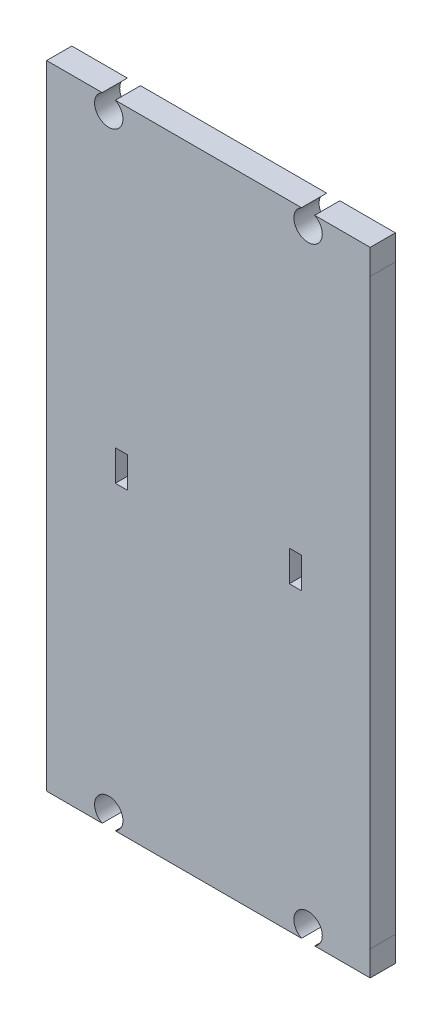
ISO-10303-21;
HEADER;
FILE_DESCRIPTION(('STEP AP214'),'2;1');
FILE_NAME('part.step','',(''),(''),'','','');
FILE_SCHEMA(('AUTOMOTIVE_DESIGN { 1 0 10303 214 1 1 1 1 }'));
ENDSEC;
DATA;
#1=APPLICATION_CONTEXT('core data for automotive mechanical design processes');
#2=APPLICATION_PROTOCOL_DEFINITION('international standard','automotive_design',2000,#1);
#3=PRODUCT_CONTEXT('',#1,'mechanical');
#4=PRODUCT('Part','Part','',(#3));
#5=PRODUCT_RELATED_PRODUCT_CATEGORY('part','',(#4));
#6=PRODUCT_DEFINITION_FORMATION('','',#4);
#7=PRODUCT_DEFINITION_CONTEXT('part definition',#1,'design');
#8=PRODUCT_DEFINITION('design','',#6,#7);
#9=PRODUCT_DEFINITION_SHAPE('','',#8);
#10=(LENGTH_UNIT() NAMED_UNIT(*) SI_UNIT(.MILLI.,.METRE.));
#11=(NAMED_UNIT(*) PLANE_ANGLE_UNIT() SI_UNIT($,.RADIAN.));
#12=(NAMED_UNIT(*) SI_UNIT($,.STERADIAN.) SOLID_ANGLE_UNIT());
#13=UNCERTAINTY_MEASURE_WITH_UNIT(LENGTH_MEASURE(1.E-05),#10,'distance_accuracy_value','');
#14=(GEOMETRIC_REPRESENTATION_CONTEXT(3) GLOBAL_UNCERTAINTY_ASSIGNED_CONTEXT((#13)) GLOBAL_UNIT_ASSIGNED_CONTEXT((#10,
#11,#12)) REPRESENTATION_CONTEXT('',''));
#15=CARTESIAN_POINT('',(0.,0.,0.));
#16=DIRECTION('',(0.,0.,1.));
#17=DIRECTION('',(1.,0.,0.));
#18=AXIS2_PLACEMENT_3D('',#15,#16,#17);
#19=CARTESIAN_POINT('',(12.4815956002516,-37.5639870162427,3.1115));
#20=DIRECTION('',(0.,0.,1.));
#21=DIRECTION('',(1.,0.,0.));
#22=AXIS2_PLACEMENT_3D('',#19,#20,#21);
#23=PLANE('',#22);
#24=DIRECTION('',(1.,0.,0.));
#25=VECTOR('',#24,1.);
#26=CARTESIAN_POINT('',(10.1620433458057,-1.9133805045045,3.1115));
#27=LINE('',#26,#25);
#28=CARTESIAN_POINT('',(10.1620433458057,-1.9133805045045,3.1115));
#29=VERTEX_POINT('',#28);
#30=CARTESIAN_POINT('',(11.6720433458056,-1.9133805045045,3.1115));
#31=VERTEX_POINT('',#30);
#32=EDGE_CURVE('E226',#29,#31,#27,.T.);
#33=ORIENTED_EDGE('',*,*,#32,.F.);
#34=DIRECTION('',(0.,-1.,0.));
#35=VECTOR('',#34,1.);
#36=CARTESIAN_POINT('',(10.1620433458057,1.89661949549551,3.1115));
#37=LINE('',#36,#35);
#38=CARTESIAN_POINT('',(10.1620433458057,1.89661949549551,3.1115));
#39=VERTEX_POINT('',#38);
#40=EDGE_CURVE('E224',#39,#29,#37,.T.);
#41=ORIENTED_EDGE('',*,*,#40,.F.);
#42=DIRECTION('',(-1.,0.,0.));
#43=VECTOR('',#42,1.);
#44=CARTESIAN_POINT('',(11.6720433458056,1.89661949549551,3.1115));
#45=LINE('',#44,#43);
#46=CARTESIAN_POINT('',(11.6720433458056,1.89661949549551,3.1115));
#47=VERTEX_POINT('',#46);
#48=EDGE_CURVE('E232',#47,#39,#45,.T.);
#49=ORIENTED_EDGE('',*,*,#48,.F.);
#50=DIRECTION('',(0.,1.,0.));
#51=VECTOR('',#50,1.);
#52=CARTESIAN_POINT('',(11.6720433458056,-1.9133805045045,3.1115));
#53=LINE('',#52,#51);
#54=EDGE_CURVE('E229',#31,#47,#53,.T.);
#55=ORIENTED_EDGE('',*,*,#54,.F.);
#56=EDGE_LOOP('',(#33,#41,#49,#55));
#57=FACE_BOUND('',#56,.T.);
#58=CARTESIAN_POINT('',(12.4815956002516,-37.5639870162427,3.1115));
#59=DIRECTION('',(0.,0.,-1.));
#60=DIRECTION('',(1.,0.,0.));
#61=AXIS2_PLACEMENT_3D('',#58,#59,#60);
#62=CIRCLE('',#61,1.75500000000009);
#63=CARTESIAN_POINT('',(11.6693674261273,-39.1197216957943,3.1115));
#64=VERTEX_POINT('',#63);
#65=CARTESIAN_POINT('',(13.2937654308429,-39.1197521547766,3.1115));
#66=VERTEX_POINT('',#65);
#67=EDGE_CURVE('E253',#64,#66,#62,.T.);
#68=ORIENTED_EDGE('',*,*,#67,.T.);
#69=DIRECTION('',(0.999999999824201,-1.87509355756312E-05,0.));
#70=VECTOR('',#69,1.);
#71=CARTESIAN_POINT('',(13.2937654308429,-39.1197521547766,3.1115));
#72=LINE('',#71,#70);
#73=CARTESIAN_POINT('',(20.161810992237,-39.1198809370565,3.1115));
#74=VERTEX_POINT('',#73);
#75=EDGE_CURVE('E256',#66,#74,#72,.T.);
#76=ORIENTED_EDGE('',*,*,#75,.T.);
#77=DIRECTION('',(1.87509355376572E-05,0.999999999824201,0.));
#78=VECTOR('',#77,1.);
#79=CARTESIAN_POINT('',(20.161810992237,-39.1198809370565,3.1115));
#80=LINE('',#79,#78);
#81=CARTESIAN_POINT('',(20.1618693076465,-36.0098809376032,3.1115));
#82=VERTEX_POINT('',#81);
#83=EDGE_CURVE('E259',#74,#82,#80,.T.);
#84=ORIENTED_EDGE('',*,*,#83,.T.);
#85=DIRECTION('',(4.78271407325755E-06,0.999999999988563,0.));
#86=VECTOR('',#85,1.);
#87=CARTESIAN_POINT('',(20.1622136630598,35.9901190615735,3.1115));
#88=LINE('',#87,#86);
#89=CARTESIAN_POINT('',(20.1622136630598,35.9901190615735,3.1115));
#90=VERTEX_POINT('',#89);
#91=EDGE_CURVE('E261',#82,#90,#88,.T.);
#92=ORIENTED_EDGE('',*,*,#91,.T.);
#93=DIRECTION('',(0.,1.,0.));
#94=VECTOR('',#93,1.);
#95=CARTESIAN_POINT('',(20.1622136630598,35.9901190615735,3.1115));
#96=LINE('',#95,#94);
#97=CARTESIAN_POINT('',(20.1622136630598,39.1001190584732,3.1115));
#98=VERTEX_POINT('',#97);
#99=EDGE_CURVE('E263',#90,#98,#96,.T.);
#100=ORIENTED_EDGE('',*,*,#99,.T.);
#101=DIRECTION('',(-1.,0.,0.));
#102=VECTOR('',#101,1.);
#103=CARTESIAN_POINT('',(20.1622136630598,39.1001190584732,3.1115));
#104=LINE('',#103,#102);
#105=CARTESIAN_POINT('',(13.2944987787251,39.1001190584732,3.1115));
#106=VERTEX_POINT('',#105);
#107=EDGE_CURVE('E265',#98,#106,#104,.T.);
#108=ORIENTED_EDGE('',*,*,#107,.T.);
#109=CARTESIAN_POINT('',(12.4822997762245,37.5443691491571,3.1115));
#110=DIRECTION('',(0.,0.,-1.));
#111=DIRECTION('',(-1.,0.,0.));
#112=AXIS2_PLACEMENT_3D('',#109,#110,#111);
#113=CIRCLE('',#112,1.75500000000001);
#114=CARTESIAN_POINT('',(11.6701007737239,39.1001190584732,3.1115));
#115=VERTEX_POINT('',#114);
#116=EDGE_CURVE('E267',#106,#115,#113,.T.);
#117=ORIENTED_EDGE('',*,*,#116,.T.);
#118=DIRECTION('',(-1.,0.,0.));
#119=VECTOR('',#118,1.);
#120=CARTESIAN_POINT('',(11.6701007737239,39.1001190584732,3.1115));
#121=LINE('',#120,#119);
#122=CARTESIAN_POINT('',(-11.3460140821123,39.1001190584732,3.1115));
#123=VERTEX_POINT('',#122);
#124=EDGE_CURVE('E269',#115,#123,#121,.T.);
#125=ORIENTED_EDGE('',*,*,#124,.T.);
#126=CARTESIAN_POINT('',(-12.1582130846129,37.5443691491571,3.1115));
#127=DIRECTION('',(0.,0.,-1.));
#128=DIRECTION('',(1.,0.,0.));
#129=AXIS2_PLACEMENT_3D('',#126,#127,#128);
#130=CIRCLE('',#129,1.75500000000001);
#131=CARTESIAN_POINT('',(-12.9704120871134,39.1001190584732,3.1115));
#132=VERTEX_POINT('',#131);
#133=EDGE_CURVE('E271',#123,#132,#130,.T.);
#134=ORIENTED_EDGE('',*,*,#133,.T.);
#135=DIRECTION('',(-1.,0.,0.));
#136=VECTOR('',#135,1.);
#137=CARTESIAN_POINT('',(-12.9704120871134,39.1001190584732,3.1115));
#138=LINE('',#137,#136);
#139=CARTESIAN_POINT('',(-19.8378399810143,39.1001190584732,3.1115));
#140=VERTEX_POINT('',#139);
#141=EDGE_CURVE('E273',#132,#140,#138,.T.);
#142=ORIENTED_EDGE('',*,*,#141,.T.);
#143=DIRECTION('',(-1.32158172241815E-06,-0.999999999999127,0.));
#144=VECTOR('',#143,1.);
#145=CARTESIAN_POINT('',(-19.8378399810143,39.1001190584732,3.1115));
#146=LINE('',#145,#144);
#147=CARTESIAN_POINT('',(-19.8379392440263,-36.0091309040397,3.1115));
#148=VERTEX_POINT('',#147);
#149=EDGE_CURVE('E275',#140,#148,#146,.T.);
#150=ORIENTED_EDGE('',*,*,#149,.T.);
#151=DIRECTION('',(-5.59642769559456E-06,-0.99999999998434,0.));
#152=VECTOR('',#151,1.);
#153=CARTESIAN_POINT('',(-19.8379392440263,-36.0091309040397,3.1115));
#154=LINE('',#153,#152);
#155=CARTESIAN_POINT('',(-19.8379566489164,-39.119130903991,3.1115));
#156=VERTEX_POINT('',#155);
#157=EDGE_CURVE('E277',#148,#156,#154,.T.);
#158=ORIENTED_EDGE('',*,*,#157,.T.);
#159=DIRECTION('',(0.999999999824201,-1.87509355584966E-05,0.));
#160=VECTOR('',#159,1.);
#161=CARTESIAN_POINT('',(-19.8379566489164,-39.119130903991,3.1115));
#162=LINE('',#161,#160);
#163=CARTESIAN_POINT('',(-12.9711454303783,-39.1192596631256,3.1115));
#164=VERTEX_POINT('',#163);
#165=EDGE_CURVE('E279',#156,#164,#162,.T.);
#166=ORIENTED_EDGE('',*,*,#165,.T.);
#167=CARTESIAN_POINT('',(-12.158917256254,-37.5635249835742,3.1115));
#168=DIRECTION('',(0.,0.,-1.));
#169=DIRECTION('',(-1.,0.,0.));
#170=AXIS2_PLACEMENT_3D('',#167,#168,#169);
#171=CIRCLE('',#170,1.75500000000001);
#172=CARTESIAN_POINT('',(-11.3467474256626,-39.119290122108,3.1115));
#173=VERTEX_POINT('',#172);
#174=EDGE_CURVE('E281',#164,#173,#171,.T.);
#175=ORIENTED_EDGE('',*,*,#174,.T.);
#176=DIRECTION('',(0.999999999824201,-1.87509355536629E-05,0.));
#177=VECTOR('',#176,1.);
#178=CARTESIAN_POINT('',(-11.3467474256627,-39.1192901221079,3.1115));
#179=LINE('',#178,#177);
#180=EDGE_CURVE('E283',#173,#64,#179,.T.);
#181=ORIENTED_EDGE('',*,*,#180,.T.);
#182=EDGE_LOOP('',(#68,#76,#84,#92,#100,#108,#117,#125,#134,#142,#150,#158,#166,#175,#181));
#183=FACE_BOUND('',#182,.T.);
#184=DIRECTION('',(0.,-1.,0.));
#185=VECTOR('',#184,1.);
#186=CARTESIAN_POINT('',(-11.3479566541943,-1.9133805045045,3.1115));
#187=LINE('',#186,#185);
#188=CARTESIAN_POINT('',(-11.3479566541943,1.89661949549551,3.1115));
#189=VERTEX_POINT('',#188);
#190=CARTESIAN_POINT('',(-11.3479566541943,-1.9133805045045,3.1115));
#191=VERTEX_POINT('',#190);
#192=EDGE_CURVE('E196',#189,#191,#187,.T.);
#193=ORIENTED_EDGE('',*,*,#192,.F.);
#194=DIRECTION('',(-1.,0.,0.));
#195=VECTOR('',#194,1.);
#196=CARTESIAN_POINT('',(-11.3479566541943,1.89661949549551,3.1115));
#197=LINE('',#196,#195);
#198=CARTESIAN_POINT('',(-9.83795665419433,1.89661949549551,3.1115));
#199=VERTEX_POINT('',#198);
#200=EDGE_CURVE('E188',#199,#189,#197,.T.);
#201=ORIENTED_EDGE('',*,*,#200,.F.);
#202=DIRECTION('',(0.,1.,0.));
#203=VECTOR('',#202,1.);
#204=CARTESIAN_POINT('',(-9.83795665419433,-0.00838050450450989,3.1115));
#205=LINE('',#204,#203);
#206=CARTESIAN_POINT('',(-9.83795665419433,-1.9133805045045,3.1115));
#207=VERTEX_POINT('',#206);
#208=EDGE_CURVE('E210',#207,#199,#205,.T.);
#209=ORIENTED_EDGE('',*,*,#208,.F.);
#210=DIRECTION('',(1.,0.,0.));
#211=VECTOR('',#210,1.);
#212=CARTESIAN_POINT('',(-9.83795665419433,-1.9133805045045,3.1115));
#213=LINE('',#212,#211);
#214=EDGE_CURVE('E208',#191,#207,#213,.T.);
#215=ORIENTED_EDGE('',*,*,#214,.F.);
#216=EDGE_LOOP('',(#193,#201,#209,#215));
#217=FACE_BOUND('',#216,.T.);
#218=ADVANCED_FACE('F33',(#57,#183,#217),#23,.T.);
#219=CARTESIAN_POINT('',(12.4815956002516,-37.5639870162427,0.));
#220=DIRECTION('',(0.,0.,1.));
#221=DIRECTION('',(1.,0.,0.));
#222=AXIS2_PLACEMENT_3D('',#219,#220,#221);
#223=PLANE('',#222);
#224=DIRECTION('',(0.,-1.,0.));
#225=VECTOR('',#224,1.);
#226=CARTESIAN_POINT('',(10.1620433458057,-0.00838050450450989,0.));
#227=LINE('',#226,#225);
#228=CARTESIAN_POINT('',(10.1620433458057,1.89661949549551,0.));
#229=VERTEX_POINT('',#228);
#230=CARTESIAN_POINT('',(10.1620433458057,-1.9133805045045,0.));
#231=VERTEX_POINT('',#230);
#232=EDGE_CURVE('E204',#229,#231,#227,.T.);
#233=ORIENTED_EDGE('',*,*,#232,.T.);
#234=DIRECTION('',(1.,0.,0.));
#235=VECTOR('',#234,1.);
#236=CARTESIAN_POINT('',(10.1620433458057,-1.9133805045045,0.));
#237=LINE('',#236,#235);
#238=CARTESIAN_POINT('',(11.6720433458056,-1.9133805045045,0.));
#239=VERTEX_POINT('',#238);
#240=EDGE_CURVE('E237',#231,#239,#237,.T.);
#241=ORIENTED_EDGE('',*,*,#240,.T.);
#242=DIRECTION('',(0.,1.,0.));
#243=VECTOR('',#242,1.);
#244=CARTESIAN_POINT('',(11.6720433458056,-1.9133805045045,0.));
#245=LINE('',#244,#243);
#246=CARTESIAN_POINT('',(11.6720433458056,1.89661949549551,0.));
#247=VERTEX_POINT('',#246);
#248=EDGE_CURVE('E240',#239,#247,#245,.T.);
#249=ORIENTED_EDGE('',*,*,#248,.T.);
#250=DIRECTION('',(-1.,0.,0.));
#251=VECTOR('',#250,1.);
#252=CARTESIAN_POINT('',(11.6720433458056,1.89661949549551,0.));
#253=LINE('',#252,#251);
#254=EDGE_CURVE('E227',#247,#229,#253,.T.);
#255=ORIENTED_EDGE('',*,*,#254,.T.);
#256=EDGE_LOOP('',(#233,#241,#249,#255));
#257=FACE_BOUND('',#256,.T.);
#258=CARTESIAN_POINT('',(12.4815956002516,-37.5639870162427,0.));
#259=DIRECTION('',(0.,0.,-1.));
#260=DIRECTION('',(1.,0.,0.));
#261=AXIS2_PLACEMENT_3D('',#258,#259,#260);
#262=CIRCLE('',#261,1.75500000000009);
#263=CARTESIAN_POINT('',(11.6693674261273,-39.1197216957943,0.));
#264=VERTEX_POINT('',#263);
#265=CARTESIAN_POINT('',(13.2937654308429,-39.1197521547766,0.));
#266=VERTEX_POINT('',#265);
#267=EDGE_CURVE('E252',#264,#266,#262,.T.);
#268=ORIENTED_EDGE('',*,*,#267,.F.);
#269=DIRECTION('',(0.999999999824201,-1.87509355536629E-05,0.));
#270=VECTOR('',#269,1.);
#271=CARTESIAN_POINT('',(-11.3467474256627,-39.1192901221079,0.));
#272=LINE('',#271,#270);
#273=CARTESIAN_POINT('',(-11.3467474256626,-39.119290122108,0.));
#274=VERTEX_POINT('',#273);
#275=EDGE_CURVE('E257',#274,#264,#272,.T.);
#276=ORIENTED_EDGE('',*,*,#275,.F.);
#277=CARTESIAN_POINT('',(-12.158917256254,-37.5635249835742,0.));
#278=DIRECTION('',(0.,0.,-1.));
#279=DIRECTION('',(-1.,0.,0.));
#280=AXIS2_PLACEMENT_3D('',#277,#278,#279);
#281=CIRCLE('',#280,1.75500000000001);
#282=CARTESIAN_POINT('',(-12.9711454303783,-39.1192596631256,0.));
#283=VERTEX_POINT('',#282);
#284=EDGE_CURVE('E313',#283,#274,#281,.T.);
#285=ORIENTED_EDGE('',*,*,#284,.F.);
#286=DIRECTION('',(0.999999999824201,-1.87509355584966E-05,0.));
#287=VECTOR('',#286,1.);
#288=CARTESIAN_POINT('',(-19.8379566489164,-39.119130903991,0.));
#289=LINE('',#288,#287);
#290=CARTESIAN_POINT('',(-19.8379566489164,-39.119130903991,0.));
#291=VERTEX_POINT('',#290);
#292=EDGE_CURVE('E311',#291,#283,#289,.T.);
#293=ORIENTED_EDGE('',*,*,#292,.F.);
#294=DIRECTION('',(-5.59642769559456E-06,-0.99999999998434,0.));
#295=VECTOR('',#294,1.);
#296=CARTESIAN_POINT('',(-19.8379392440263,-36.0091309040397,0.));
#297=LINE('',#296,#295);
#298=CARTESIAN_POINT('',(-19.8379392440263,-36.0091309040397,0.));
#299=VERTEX_POINT('',#298);
#300=EDGE_CURVE('E309',#299,#291,#297,.T.);
#301=ORIENTED_EDGE('',*,*,#300,.F.);
#302=DIRECTION('',(-1.32158172241815E-06,-0.999999999999127,0.));
#303=VECTOR('',#302,1.);
#304=CARTESIAN_POINT('',(-19.8378399810143,39.1001190584732,0.));
#305=LINE('',#304,#303);
#306=CARTESIAN_POINT('',(-19.8378399810143,39.1001190584732,0.));
#307=VERTEX_POINT('',#306);
#308=EDGE_CURVE('E307',#307,#299,#305,.T.);
#309=ORIENTED_EDGE('',*,*,#308,.F.);
#310=DIRECTION('',(-1.,0.,0.));
#311=VECTOR('',#310,1.);
#312=CARTESIAN_POINT('',(-12.9704120871134,39.1001190584732,0.));
#313=LINE('',#312,#311);
#314=CARTESIAN_POINT('',(-12.9704120871134,39.1001190584732,0.));
#315=VERTEX_POINT('',#314);
#316=EDGE_CURVE('E305',#315,#307,#313,.T.);
#317=ORIENTED_EDGE('',*,*,#316,.F.);
#318=CARTESIAN_POINT('',(-12.1582130846129,37.5443691491571,0.));
#319=DIRECTION('',(0.,0.,-1.));
#320=DIRECTION('',(1.,0.,0.));
#321=AXIS2_PLACEMENT_3D('',#318,#319,#320);
#322=CIRCLE('',#321,1.75500000000001);
#323=CARTESIAN_POINT('',(-11.3460140821123,39.1001190584732,0.));
#324=VERTEX_POINT('',#323);
#325=EDGE_CURVE('E303',#324,#315,#322,.T.);
#326=ORIENTED_EDGE('',*,*,#325,.F.);
#327=DIRECTION('',(-1.,0.,0.));
#328=VECTOR('',#327,1.);
#329=CARTESIAN_POINT('',(11.6701007737239,39.1001190584732,0.));
#330=LINE('',#329,#328);
#331=CARTESIAN_POINT('',(11.6701007737239,39.1001190584732,0.));
#332=VERTEX_POINT('',#331);
#333=EDGE_CURVE('E301',#332,#324,#330,.T.);
#334=ORIENTED_EDGE('',*,*,#333,.F.);
#335=CARTESIAN_POINT('',(12.4822997762245,37.5443691491571,0.));
#336=DIRECTION('',(0.,0.,-1.));
#337=DIRECTION('',(-1.,0.,0.));
#338=AXIS2_PLACEMENT_3D('',#335,#336,#337);
#339=CIRCLE('',#338,1.75500000000001);
#340=CARTESIAN_POINT('',(13.2944987787251,39.1001190584732,0.));
#341=VERTEX_POINT('',#340);
#342=EDGE_CURVE('E299',#341,#332,#339,.T.);
#343=ORIENTED_EDGE('',*,*,#342,.F.);
#344=DIRECTION('',(-1.,0.,0.));
#345=VECTOR('',#344,1.);
#346=CARTESIAN_POINT('',(13.3522375558519,39.1001190584732,0.));
#347=LINE('',#346,#345);
#348=CARTESIAN_POINT('',(20.1622136630598,39.1001190584732,0.));
#349=VERTEX_POINT('',#348);
#350=EDGE_CURVE('E297',#349,#341,#347,.T.);
#351=ORIENTED_EDGE('',*,*,#350,.F.);
#352=DIRECTION('',(0.,1.,0.));
#353=VECTOR('',#352,1.);
#354=CARTESIAN_POINT('',(20.1622136630598,35.9901190615735,0.));
#355=LINE('',#354,#353);
#356=CARTESIAN_POINT('',(20.1622136630598,35.9901190615735,0.));
#357=VERTEX_POINT('',#356);
#358=EDGE_CURVE('E294',#357,#349,#355,.T.);
#359=ORIENTED_EDGE('',*,*,#358,.F.);
#360=DIRECTION('',(4.78271407325755E-06,0.999999999988563,0.));
#361=VECTOR('',#360,1.);
#362=CARTESIAN_POINT('',(20.1622136630598,35.9901190615735,0.));
#363=LINE('',#362,#361);
#364=CARTESIAN_POINT('',(20.1618693076465,-36.0098809376032,0.));
#365=VERTEX_POINT('',#364);
#366=EDGE_CURVE('E292',#365,#357,#363,.T.);
#367=ORIENTED_EDGE('',*,*,#366,.F.);
#368=DIRECTION('',(1.87509355376572E-05,0.999999999824201,0.));
#369=VECTOR('',#368,1.);
#370=CARTESIAN_POINT('',(20.161810992237,-39.1198809370565,0.));
#371=LINE('',#370,#369);
#372=CARTESIAN_POINT('',(20.161810992237,-39.1198809370565,0.));
#373=VERTEX_POINT('',#372);
#374=EDGE_CURVE('E290',#373,#365,#371,.T.);
#375=ORIENTED_EDGE('',*,*,#374,.F.);
#376=DIRECTION('',(0.999999999824201,-1.87509355756312E-05,0.));
#377=VECTOR('',#376,1.);
#378=CARTESIAN_POINT('',(13.2937654308429,-39.1197521547766,0.));
#379=LINE('',#378,#377);
#380=EDGE_CURVE('E288',#266,#373,#379,.T.);
#381=ORIENTED_EDGE('',*,*,#380,.F.);
#382=EDGE_LOOP('',(#268,#276,#285,#293,#301,#309,#317,#326,#334,#343,#351,#359,#367,#375,#381));
#383=FACE_BOUND('',#382,.T.);
#384=DIRECTION('',(-1.,0.,0.));
#385=VECTOR('',#384,1.);
#386=CARTESIAN_POINT('',(-11.3479566541943,1.89661949549551,0.));
#387=LINE('',#386,#385);
#388=CARTESIAN_POINT('',(-9.83795665419433,1.89661949549551,0.));
#389=VERTEX_POINT('',#388);
#390=CARTESIAN_POINT('',(-11.3479566541943,1.89661949549551,0.));
#391=VERTEX_POINT('',#390);
#392=EDGE_CURVE('E56',#389,#391,#387,.T.);
#393=ORIENTED_EDGE('',*,*,#392,.T.);
#394=DIRECTION('',(0.,-1.,0.));
#395=VECTOR('',#394,1.);
#396=CARTESIAN_POINT('',(-11.3479566541943,-1.9133805045045,0.));
#397=LINE('',#396,#395);
#398=CARTESIAN_POINT('',(-11.3479566541943,-1.9133805045045,0.));
#399=VERTEX_POINT('',#398);
#400=EDGE_CURVE('E203',#391,#399,#397,.T.);
#401=ORIENTED_EDGE('',*,*,#400,.T.);
#402=DIRECTION('',(1.,0.,0.));
#403=VECTOR('',#402,1.);
#404=CARTESIAN_POINT('',(-9.83795665419433,-1.9133805045045,0.));
#405=LINE('',#404,#403);
#406=CARTESIAN_POINT('',(-9.83795665419433,-1.9133805045045,0.));
#407=VERTEX_POINT('',#406);
#408=EDGE_CURVE('E216',#399,#407,#405,.T.);
#409=ORIENTED_EDGE('',*,*,#408,.T.);
#410=DIRECTION('',(0.,1.,0.));
#411=VECTOR('',#410,1.);
#412=CARTESIAN_POINT('',(-9.83795665419433,1.89661949549551,0.));
#413=LINE('',#412,#411);
#414=EDGE_CURVE('E197',#407,#389,#413,.T.);
#415=ORIENTED_EDGE('',*,*,#414,.T.);
#416=EDGE_LOOP('',(#393,#401,#409,#415));
#417=FACE_BOUND('',#416,.T.);
#418=ADVANCED_FACE('F364',(#257,#383,#417),#223,.F.);
#419=CARTESIAN_POINT('',(12.4815956002516,-37.5639870162427,3.1115));
#420=DIRECTION('',(0.,0.,-1.));
#421=DIRECTION('',(-1.,0.,0.));
#422=AXIS2_PLACEMENT_3D('',#419,#420,#421);
#423=CYLINDRICAL_SURFACE('',#422,1.75500000000009);
#424=ORIENTED_EDGE('',*,*,#267,.T.);
#425=DIRECTION('',(0.,0.,-1.));
#426=VECTOR('',#425,1.);
#427=CARTESIAN_POINT('',(13.2937654308429,-39.1197521547766,3.1115));
#428=LINE('',#427,#426);
#429=EDGE_CURVE('E11',#66,#266,#428,.T.);
#430=ORIENTED_EDGE('',*,*,#429,.F.);
#431=ORIENTED_EDGE('',*,*,#67,.F.);
#432=DIRECTION('',(0.,0.,-1.));
#433=VECTOR('',#432,1.);
#434=CARTESIAN_POINT('',(11.6693674261273,-39.1197216957943,3.1115));
#435=LINE('',#434,#433);
#436=EDGE_CURVE('E285',#64,#264,#435,.T.);
#437=ORIENTED_EDGE('',*,*,#436,.T.);
#438=EDGE_LOOP('',(#424,#430,#431,#437));
#439=FACE_BOUND('',#438,.T.);
#440=ADVANCED_FACE('F35',(#439),#423,.F.);
#441=CARTESIAN_POINT('',(13.2937654308429,-39.1197521547766,3.1115));
#442=DIRECTION('',(1.87509355756312E-05,0.999999999824201,0.));
#443=DIRECTION('',(-0.999999999824201,1.87509355756312E-05,0.));
#444=AXIS2_PLACEMENT_3D('',#441,#442,#443);
#445=PLANE('',#444);
#446=ORIENTED_EDGE('',*,*,#380,.T.);
#447=DIRECTION('',(0.,0.,-1.));
#448=VECTOR('',#447,1.);
#449=CARTESIAN_POINT('',(20.161810992237,-39.1198809370565,3.1115));
#450=LINE('',#449,#448);
#451=EDGE_CURVE('E41',#74,#373,#450,.T.);
#452=ORIENTED_EDGE('',*,*,#451,.F.);
#453=ORIENTED_EDGE('',*,*,#75,.F.);
#454=ORIENTED_EDGE('',*,*,#429,.T.);
#455=EDGE_LOOP('',(#446,#452,#453,#454));
#456=FACE_BOUND('',#455,.T.);
#457=ADVANCED_FACE('F380',(#456),#445,.F.);
#458=CARTESIAN_POINT('',(20.161810992237,-39.1198809370565,3.1115));
#459=DIRECTION('',(-0.999999999824201,1.87509355376572E-05,0.));
#460=DIRECTION('',(-1.87509355376572E-05,-0.999999999824201,0.));
#461=AXIS2_PLACEMENT_3D('',#458,#459,#460);
#462=PLANE('',#461);
#463=ORIENTED_EDGE('',*,*,#374,.T.);
#464=DIRECTION('',(0.,0.,-1.));
#465=VECTOR('',#464,1.);
#466=CARTESIAN_POINT('',(20.1618693076465,-36.0098809376032,3.1115));
#467=LINE('',#466,#465);
#468=EDGE_CURVE('E351',#82,#365,#467,.T.);
#469=ORIENTED_EDGE('',*,*,#468,.F.);
#470=ORIENTED_EDGE('',*,*,#83,.F.);
#471=ORIENTED_EDGE('',*,*,#451,.T.);
#472=EDGE_LOOP('',(#463,#469,#470,#471));
#473=FACE_BOUND('',#472,.T.);
#474=ADVANCED_FACE('F358',(#473),#462,.F.);
#475=CARTESIAN_POINT('',(20.1622136630598,35.9901190615735,3.1115));
#476=DIRECTION('',(-0.999999999988563,4.78271407325755E-06,0.));
#477=DIRECTION('',(-4.78271407325755E-06,-0.999999999988563,0.));
#478=AXIS2_PLACEMENT_3D('',#475,#476,#477);
#479=PLANE('',#478);
#480=ORIENTED_EDGE('',*,*,#366,.T.);
#481=DIRECTION('',(0.,0.,-1.));
#482=VECTOR('',#481,1.);
#483=CARTESIAN_POINT('',(20.1622136630598,35.9901190615735,3.1115));
#484=LINE('',#483,#482);
#485=EDGE_CURVE('E348',#90,#357,#484,.T.);
#486=ORIENTED_EDGE('',*,*,#485,.F.);
#487=ORIENTED_EDGE('',*,*,#91,.F.);
#488=ORIENTED_EDGE('',*,*,#468,.T.);
#489=EDGE_LOOP('',(#480,#486,#487,#488));
#490=FACE_BOUND('',#489,.T.);
#491=ADVANCED_FACE('F369',(#490),#479,.F.);
#492=CARTESIAN_POINT('',(20.1622136630598,35.9901190615735,3.1115));
#493=DIRECTION('',(-1.,0.,0.));
#494=DIRECTION('',(0.,0.,1.));
#495=AXIS2_PLACEMENT_3D('',#492,#493,#494);
#496=PLANE('',#495);
#497=ORIENTED_EDGE('',*,*,#358,.T.);
#498=DIRECTION('',(0.,0.,-1.));
#499=VECTOR('',#498,1.);
#500=CARTESIAN_POINT('',(20.1622136630598,39.1001190584732,3.1115));
#501=LINE('',#500,#499);
#502=EDGE_CURVE('E345',#98,#349,#501,.T.);
#503=ORIENTED_EDGE('',*,*,#502,.F.);
#504=ORIENTED_EDGE('',*,*,#99,.F.);
#505=ORIENTED_EDGE('',*,*,#485,.T.);
#506=EDGE_LOOP('',(#497,#503,#504,#505));
#507=FACE_BOUND('',#506,.T.);
#508=ADVANCED_FACE('F373',(#507),#496,.F.);
#509=CARTESIAN_POINT('',(13.3522375558519,39.1001190584732,3.1115));
#510=DIRECTION('',(0.,-1.,0.));
#511=DIRECTION('',(0.,0.,-1.));
#512=AXIS2_PLACEMENT_3D('',#509,#510,#511);
#513=PLANE('',#512);
#514=ORIENTED_EDGE('',*,*,#350,.T.);
#515=DIRECTION('',(0.,0.,-1.));
#516=VECTOR('',#515,1.);
#517=CARTESIAN_POINT('',(13.2944987787251,39.1001190584732,3.1115));
#518=LINE('',#517,#516);
#519=EDGE_CURVE('E342',#106,#341,#518,.T.);
#520=ORIENTED_EDGE('',*,*,#519,.F.);
#521=ORIENTED_EDGE('',*,*,#107,.F.);
#522=ORIENTED_EDGE('',*,*,#502,.T.);
#523=EDGE_LOOP('',(#514,#520,#521,#522));
#524=FACE_BOUND('',#523,.T.);
#525=ADVANCED_FACE('F428',(#524),#513,.F.);
#526=CARTESIAN_POINT('',(12.4822997762245,37.5443691491571,3.1115));
#527=DIRECTION('',(0.,0.,-1.));
#528=DIRECTION('',(-1.,0.,0.));
#529=AXIS2_PLACEMENT_3D('',#526,#527,#528);
#530=CYLINDRICAL_SURFACE('',#529,1.75500000000001);
#531=ORIENTED_EDGE('',*,*,#342,.T.);
#532=DIRECTION('',(0.,0.,-1.));
#533=VECTOR('',#532,1.);
#534=CARTESIAN_POINT('',(11.6701007737239,39.1001190584732,3.1115));
#535=LINE('',#534,#533);
#536=EDGE_CURVE('E339',#115,#332,#535,.T.);
#537=ORIENTED_EDGE('',*,*,#536,.F.);
#538=ORIENTED_EDGE('',*,*,#116,.F.);
#539=ORIENTED_EDGE('',*,*,#519,.T.);
#540=EDGE_LOOP('',(#531,#537,#538,#539));
#541=FACE_BOUND('',#540,.T.);
#542=ADVANCED_FACE('F426',(#541),#530,.F.);
#543=CARTESIAN_POINT('',(11.6701007737239,39.1001190584732,3.1115));
#544=DIRECTION('',(0.,-1.,0.));
#545=DIRECTION('',(0.,0.,-1.));
#546=AXIS2_PLACEMENT_3D('',#543,#544,#545);
#547=PLANE('',#546);
#548=ORIENTED_EDGE('',*,*,#333,.T.);
#549=DIRECTION('',(0.,0.,-1.));
#550=VECTOR('',#549,1.);
#551=CARTESIAN_POINT('',(-11.3460140821123,39.1001190584732,3.1115));
#552=LINE('',#551,#550);
#553=EDGE_CURVE('E336',#123,#324,#552,.T.);
#554=ORIENTED_EDGE('',*,*,#553,.F.);
#555=ORIENTED_EDGE('',*,*,#124,.F.);
#556=ORIENTED_EDGE('',*,*,#536,.T.);
#557=EDGE_LOOP('',(#548,#554,#555,#556));
#558=FACE_BOUND('',#557,.T.);
#559=ADVANCED_FACE('F422',(#558),#547,.F.);
#560=CARTESIAN_POINT('',(-12.1582130846129,37.5443691491571,3.1115));
#561=DIRECTION('',(0.,0.,-1.));
#562=DIRECTION('',(-1.,0.,0.));
#563=AXIS2_PLACEMENT_3D('',#560,#561,#562);
#564=CYLINDRICAL_SURFACE('',#563,1.75500000000001);
#565=ORIENTED_EDGE('',*,*,#325,.T.);
#566=DIRECTION('',(0.,0.,-1.));
#567=VECTOR('',#566,1.);
#568=CARTESIAN_POINT('',(-12.9704120871134,39.1001190584732,3.1115));
#569=LINE('',#568,#567);
#570=EDGE_CURVE('E333',#132,#315,#569,.T.);
#571=ORIENTED_EDGE('',*,*,#570,.F.);
#572=ORIENTED_EDGE('',*,*,#133,.F.);
#573=ORIENTED_EDGE('',*,*,#553,.T.);
#574=EDGE_LOOP('',(#565,#571,#572,#573));
#575=FACE_BOUND('',#574,.T.);
#576=ADVANCED_FACE('F417',(#575),#564,.F.);
#577=CARTESIAN_POINT('',(-12.9704120871134,39.1001190584732,3.1115));
#578=DIRECTION('',(0.,-1.,0.));
#579=DIRECTION('',(0.,0.,-1.));
#580=AXIS2_PLACEMENT_3D('',#577,#578,#579);
#581=PLANE('',#580);
#582=ORIENTED_EDGE('',*,*,#316,.T.);
#583=DIRECTION('',(0.,0.,-1.));
#584=VECTOR('',#583,1.);
#585=CARTESIAN_POINT('',(-19.8378399810143,39.1001190584732,3.1115));
#586=LINE('',#585,#584);
#587=EDGE_CURVE('E330',#140,#307,#586,.T.);
#588=ORIENTED_EDGE('',*,*,#587,.F.);
#589=ORIENTED_EDGE('',*,*,#141,.F.);
#590=ORIENTED_EDGE('',*,*,#570,.T.);
#591=EDGE_LOOP('',(#582,#588,#589,#590));
#592=FACE_BOUND('',#591,.T.);
#593=ADVANCED_FACE('F411',(#592),#581,.F.);
#594=CARTESIAN_POINT('',(-19.8378399810143,39.1001190584732,3.1115));
#595=DIRECTION('',(0.999999999999127,-1.32158172241815E-06,0.));
#596=DIRECTION('',(1.32158172241815E-06,0.999999999999127,0.));
#597=AXIS2_PLACEMENT_3D('',#594,#595,#596);
#598=PLANE('',#597);
#599=ORIENTED_EDGE('',*,*,#308,.T.);
#600=DIRECTION('',(0.,0.,-1.));
#601=VECTOR('',#600,1.);
#602=CARTESIAN_POINT('',(-19.8379392440263,-36.0091309040397,3.1115));
#603=LINE('',#602,#601);
#604=EDGE_CURVE('E327',#148,#299,#603,.T.);
#605=ORIENTED_EDGE('',*,*,#604,.F.);
#606=ORIENTED_EDGE('',*,*,#149,.F.);
#607=ORIENTED_EDGE('',*,*,#587,.T.);
#608=EDGE_LOOP('',(#599,#605,#606,#607));
#609=FACE_BOUND('',#608,.T.);
#610=ADVANCED_FACE('F407',(#609),#598,.F.);
#611=CARTESIAN_POINT('',(-19.8379392440263,-36.0091309040397,3.1115));
#612=DIRECTION('',(0.99999999998434,-5.59642769559456E-06,0.));
#613=DIRECTION('',(5.59642769559456E-06,0.99999999998434,0.));
#614=AXIS2_PLACEMENT_3D('',#611,#612,#613);
#615=PLANE('',#614);
#616=ORIENTED_EDGE('',*,*,#300,.T.);
#617=DIRECTION('',(0.,0.,-1.));
#618=VECTOR('',#617,1.);
#619=CARTESIAN_POINT('',(-19.8379566489164,-39.119130903991,3.1115));
#620=LINE('',#619,#618);
#621=EDGE_CURVE('E324',#156,#291,#620,.T.);
#622=ORIENTED_EDGE('',*,*,#621,.F.);
#623=ORIENTED_EDGE('',*,*,#157,.F.);
#624=ORIENTED_EDGE('',*,*,#604,.T.);
#625=EDGE_LOOP('',(#616,#622,#623,#624));
#626=FACE_BOUND('',#625,.T.);
#627=ADVANCED_FACE('F402',(#626),#615,.F.);
#628=CARTESIAN_POINT('',(-19.8379566489164,-39.119130903991,3.1115));
#629=DIRECTION('',(1.87509355584966E-05,0.999999999824201,0.));
#630=DIRECTION('',(-0.999999999824201,1.87509355584966E-05,0.));
#631=AXIS2_PLACEMENT_3D('',#628,#629,#630);
#632=PLANE('',#631);
#633=ORIENTED_EDGE('',*,*,#292,.T.);
#634=DIRECTION('',(0.,0.,-1.));
#635=VECTOR('',#634,1.);
#636=CARTESIAN_POINT('',(-12.9711454303783,-39.1192596631256,3.1115));
#637=LINE('',#636,#635);
#638=EDGE_CURVE('E321',#164,#283,#637,.T.);
#639=ORIENTED_EDGE('',*,*,#638,.F.);
#640=ORIENTED_EDGE('',*,*,#165,.F.);
#641=ORIENTED_EDGE('',*,*,#621,.T.);
#642=EDGE_LOOP('',(#633,#639,#640,#641));
#643=FACE_BOUND('',#642,.T.);
#644=ADVANCED_FACE('F396',(#643),#632,.F.);
#645=CARTESIAN_POINT('',(-12.158917256254,-37.5635249835742,3.1115));
#646=DIRECTION('',(0.,0.,-1.));
#647=DIRECTION('',(-1.,0.,0.));
#648=AXIS2_PLACEMENT_3D('',#645,#646,#647);
#649=CYLINDRICAL_SURFACE('',#648,1.75500000000001);
#650=ORIENTED_EDGE('',*,*,#284,.T.);
#651=DIRECTION('',(0.,0.,-1.));
#652=VECTOR('',#651,1.);
#653=CARTESIAN_POINT('',(-11.3467474256626,-39.119290122108,3.1115));
#654=LINE('',#653,#652);
#655=EDGE_CURVE('E318',#173,#274,#654,.T.);
#656=ORIENTED_EDGE('',*,*,#655,.F.);
#657=ORIENTED_EDGE('',*,*,#174,.F.);
#658=ORIENTED_EDGE('',*,*,#638,.T.);
#659=EDGE_LOOP('',(#650,#656,#657,#658));
#660=FACE_BOUND('',#659,.T.);
#661=ADVANCED_FACE('F392',(#660),#649,.F.);
#662=CARTESIAN_POINT('',(-11.3467474256627,-39.1192901221079,3.1115));
#663=DIRECTION('',(1.8750935553663E-05,0.999999999824201,0.));
#664=DIRECTION('',(-0.999999999824201,1.8750935553663E-05,0.));
#665=AXIS2_PLACEMENT_3D('',#662,#663,#664);
#666=PLANE('',#665);
#667=ORIENTED_EDGE('',*,*,#275,.T.);
#668=ORIENTED_EDGE('',*,*,#436,.F.);
#669=ORIENTED_EDGE('',*,*,#180,.F.);
#670=ORIENTED_EDGE('',*,*,#655,.T.);
#671=EDGE_LOOP('',(#667,#668,#669,#670));
#672=FACE_BOUND('',#671,.T.);
#673=ADVANCED_FACE('F387',(#672),#666,.F.);
#674=CARTESIAN_POINT('',(10.1620433458057,-0.00838050450450989,3.1115));
#675=DIRECTION('',(1.,0.,0.));
#676=DIRECTION('',(0.,1.,0.));
#677=AXIS2_PLACEMENT_3D('',#674,#675,#676);
#678=PLANE('',#677);
#679=ORIENTED_EDGE('',*,*,#232,.F.);
#680=DIRECTION('',(0.,0.,-1.));
#681=VECTOR('',#680,1.);
#682=CARTESIAN_POINT('',(10.1620433458057,1.89661949549551,3.1115));
#683=LINE('',#682,#681);
#684=EDGE_CURVE('E234',#39,#229,#683,.T.);
#685=ORIENTED_EDGE('',*,*,#684,.F.);
#686=ORIENTED_EDGE('',*,*,#40,.T.);
#687=DIRECTION('',(0.,0.,-1.));
#688=VECTOR('',#687,1.);
#689=CARTESIAN_POINT('',(10.1620433458057,-1.9133805045045,3.1115));
#690=LINE('',#689,#688);
#691=EDGE_CURVE('E250',#29,#231,#690,.T.);
#692=ORIENTED_EDGE('',*,*,#691,.T.);
#693=EDGE_LOOP('',(#679,#685,#686,#692));
#694=FACE_BOUND('',#693,.T.);
#695=ADVANCED_FACE('F447',(#694),#678,.T.);
#696=CARTESIAN_POINT('',(10.1620433458057,-1.9133805045045,3.1115));
#697=DIRECTION('',(0.,1.,0.));
#698=DIRECTION('',(0.,0.,1.));
#699=AXIS2_PLACEMENT_3D('',#696,#697,#698);
#700=PLANE('',#699);
#701=ORIENTED_EDGE('',*,*,#240,.F.);
#702=ORIENTED_EDGE('',*,*,#691,.F.);
#703=ORIENTED_EDGE('',*,*,#32,.T.);
#704=DIRECTION('',(0.,0.,-1.));
#705=VECTOR('',#704,1.);
#706=CARTESIAN_POINT('',(11.6720433458056,-1.9133805045045,3.1115));
#707=LINE('',#706,#705);
#708=EDGE_CURVE('E248',#31,#239,#707,.T.);
#709=ORIENTED_EDGE('',*,*,#708,.T.);
#710=EDGE_LOOP('',(#701,#702,#703,#709));
#711=FACE_BOUND('',#710,.T.);
#712=ADVANCED_FACE('F503',(#711),#700,.T.);
#713=CARTESIAN_POINT('',(11.6720433458056,-1.9133805045045,3.1115));
#714=DIRECTION('',(-1.,0.,0.));
#715=DIRECTION('',(0.,0.,1.));
#716=AXIS2_PLACEMENT_3D('',#713,#714,#715);
#717=PLANE('',#716);
#718=ORIENTED_EDGE('',*,*,#248,.F.);
#719=ORIENTED_EDGE('',*,*,#708,.F.);
#720=ORIENTED_EDGE('',*,*,#54,.T.);
#721=DIRECTION('',(0.,0.,-1.));
#722=VECTOR('',#721,1.);
#723=CARTESIAN_POINT('',(11.6720433458056,1.89661949549551,3.1115));
#724=LINE('',#723,#722);
#725=EDGE_CURVE('E246',#47,#247,#724,.T.);
#726=ORIENTED_EDGE('',*,*,#725,.T.);
#727=EDGE_LOOP('',(#718,#719,#720,#726));
#728=FACE_BOUND('',#727,.T.);
#729=ADVANCED_FACE('F510',(#728),#717,.T.);
#730=CARTESIAN_POINT('',(11.6720433458056,1.89661949549551,3.1115));
#731=DIRECTION('',(0.,-1.,0.));
#732=DIRECTION('',(0.,0.,-1.));
#733=AXIS2_PLACEMENT_3D('',#730,#731,#732);
#734=PLANE('',#733);
#735=ORIENTED_EDGE('',*,*,#254,.F.);
#736=ORIENTED_EDGE('',*,*,#725,.F.);
#737=ORIENTED_EDGE('',*,*,#48,.T.);
#738=ORIENTED_EDGE('',*,*,#684,.T.);
#739=EDGE_LOOP('',(#735,#736,#737,#738));
#740=FACE_BOUND('',#739,.T.);
#741=ADVANCED_FACE('F517',(#740),#734,.T.);
#742=CARTESIAN_POINT('',(-11.3479566541943,1.89661949549551,3.1115));
#743=DIRECTION('',(0.,-1.,0.));
#744=DIRECTION('',(0.,0.,-1.));
#745=AXIS2_PLACEMENT_3D('',#742,#743,#744);
#746=PLANE('',#745);
#747=ORIENTED_EDGE('',*,*,#392,.F.);
#748=DIRECTION('',(0.,0.,-1.));
#749=VECTOR('',#748,1.);
#750=CARTESIAN_POINT('',(-9.83795665419433,1.89661949549551,3.1115));
#751=LINE('',#750,#749);
#752=EDGE_CURVE('E192',#199,#389,#751,.T.);
#753=ORIENTED_EDGE('',*,*,#752,.F.);
#754=ORIENTED_EDGE('',*,*,#200,.T.);
#755=DIRECTION('',(0.,0.,-1.));
#756=VECTOR('',#755,1.);
#757=CARTESIAN_POINT('',(-11.3479566541943,1.89661949549551,3.1115));
#758=LINE('',#757,#756);
#759=EDGE_CURVE('E191',#189,#391,#758,.T.);
#760=ORIENTED_EDGE('',*,*,#759,.T.);
#761=EDGE_LOOP('',(#747,#753,#754,#760));
#762=FACE_BOUND('',#761,.T.);
#763=ADVANCED_FACE('F190',(#762),#746,.T.);
#764=CARTESIAN_POINT('',(-11.3479566541943,-1.9133805045045,3.1115));
#765=DIRECTION('',(1.,0.,0.));
#766=DIRECTION('',(0.,0.,-1.));
#767=AXIS2_PLACEMENT_3D('',#764,#765,#766);
#768=PLANE('',#767);
#769=ORIENTED_EDGE('',*,*,#400,.F.);
#770=ORIENTED_EDGE('',*,*,#759,.F.);
#771=ORIENTED_EDGE('',*,*,#192,.T.);
#772=DIRECTION('',(0.,0.,-1.));
#773=VECTOR('',#772,1.);
#774=CARTESIAN_POINT('',(-11.3479566541943,-1.9133805045045,3.1115));
#775=LINE('',#774,#773);
#776=EDGE_CURVE('E205',#191,#399,#775,.T.);
#777=ORIENTED_EDGE('',*,*,#776,.T.);
#778=EDGE_LOOP('',(#769,#770,#771,#777));
#779=FACE_BOUND('',#778,.T.);
#780=ADVANCED_FACE('F200',(#779),#768,.T.);
#781=CARTESIAN_POINT('',(-9.83795665419433,-1.9133805045045,3.1115));
#782=DIRECTION('',(0.,1.,0.));
#783=DIRECTION('',(0.,0.,1.));
#784=AXIS2_PLACEMENT_3D('',#781,#782,#783);
#785=PLANE('',#784);
#786=ORIENTED_EDGE('',*,*,#408,.F.);
#787=ORIENTED_EDGE('',*,*,#776,.F.);
#788=ORIENTED_EDGE('',*,*,#214,.T.);
#789=DIRECTION('',(0.,0.,-1.));
#790=VECTOR('',#789,1.);
#791=CARTESIAN_POINT('',(-9.83795665419433,-1.9133805045045,3.1115));
#792=LINE('',#791,#790);
#793=EDGE_CURVE('E48',#207,#407,#792,.T.);
#794=ORIENTED_EDGE('',*,*,#793,.T.);
#795=EDGE_LOOP('',(#786,#787,#788,#794));
#796=FACE_BOUND('',#795,.T.);
#797=ADVANCED_FACE('F538',(#796),#785,.T.);
#798=CARTESIAN_POINT('',(-9.83795665419433,1.89661949549551,3.1115));
#799=DIRECTION('',(-1.,0.,0.));
#800=DIRECTION('',(0.,0.,1.));
#801=AXIS2_PLACEMENT_3D('',#798,#799,#800);
#802=PLANE('',#801);
#803=ORIENTED_EDGE('',*,*,#414,.F.);
#804=ORIENTED_EDGE('',*,*,#793,.F.);
#805=ORIENTED_EDGE('',*,*,#208,.T.);
#806=ORIENTED_EDGE('',*,*,#752,.T.);
#807=EDGE_LOOP('',(#803,#804,#805,#806));
#808=FACE_BOUND('',#807,.T.);
#809=ADVANCED_FACE('F545',(#808),#802,.T.);
#810=CLOSED_SHELL('',(#218,#418,#440,#457,#474,#491,#508,#525,#542,#559,#576,#593,#610,#627,
#644,#661,#673,#695,#712,#729,#741,#763,#780,#797,#809));
#811=MANIFOLD_SOLID_BREP('B2',#810);
#812=ADVANCED_BREP_SHAPE_REPRESENTATION('',(#18,#811),#14);
#813=SHAPE_DEFINITION_REPRESENTATION(#9,#812);
ENDSEC;
END-ISO-10303-21;
